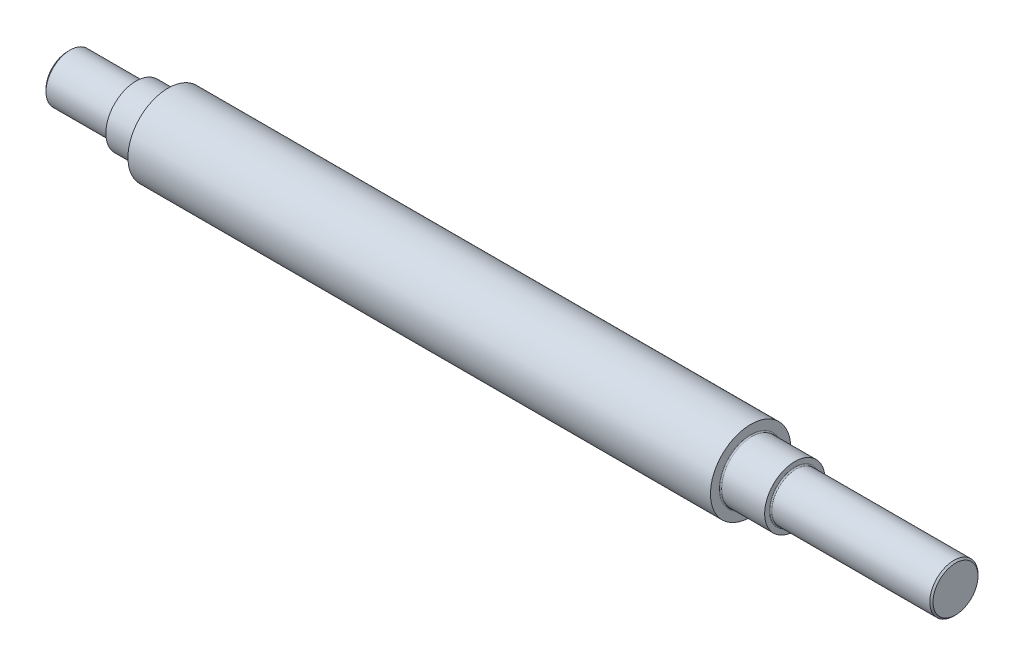
ISO-10303-21;
HEADER;
FILE_DESCRIPTION(('STEP AP214'),'2;1');
FILE_NAME('part.step','',(''),(''),'','','');
FILE_SCHEMA(('AUTOMOTIVE_DESIGN { 1 0 10303 214 1 1 1 1 }'));
ENDSEC;
DATA;
#1=APPLICATION_CONTEXT('core data for automotive mechanical design processes');
#2=APPLICATION_PROTOCOL_DEFINITION('international standard','automotive_design',2000,#1);
#3=PRODUCT_CONTEXT('',#1,'mechanical');
#4=PRODUCT('Part','Part','',(#3));
#5=PRODUCT_RELATED_PRODUCT_CATEGORY('part','',(#4));
#6=PRODUCT_DEFINITION_FORMATION('','',#4);
#7=PRODUCT_DEFINITION_CONTEXT('part definition',#1,'design');
#8=PRODUCT_DEFINITION('design','',#6,#7);
#9=PRODUCT_DEFINITION_SHAPE('','',#8);
#10=(LENGTH_UNIT() NAMED_UNIT(*) SI_UNIT(.MILLI.,.METRE.));
#11=(NAMED_UNIT(*) PLANE_ANGLE_UNIT() SI_UNIT($,.RADIAN.));
#12=(NAMED_UNIT(*) SI_UNIT($,.STERADIAN.) SOLID_ANGLE_UNIT());
#13=UNCERTAINTY_MEASURE_WITH_UNIT(LENGTH_MEASURE(1.E-05),#10,'distance_accuracy_value','');
#14=(GEOMETRIC_REPRESENTATION_CONTEXT(3) GLOBAL_UNCERTAINTY_ASSIGNED_CONTEXT((#13)) GLOBAL_UNIT_ASSIGNED_CONTEXT((#10,
#11,#12)) REPRESENTATION_CONTEXT('',''));
#15=CARTESIAN_POINT('',(0.,0.,0.));
#16=DIRECTION('',(0.,0.,1.));
#17=DIRECTION('',(1.,0.,0.));
#18=AXIS2_PLACEMENT_3D('',#15,#16,#17);
#19=CARTESIAN_POINT('',(221.,2.8,0.));
#20=DIRECTION('',(1.,0.,0.));
#21=DIRECTION('',(0.,0.,-1.));
#22=AXIS2_PLACEMENT_3D('',#19,#20,#21);
#23=PLANE('',#22);
#24=CARTESIAN_POINT('',(221.00000000006,0.,0.));
#25=DIRECTION('',(-1.,0.,0.));
#26=DIRECTION('',(0.,0.,1.));
#27=AXIS2_PLACEMENT_3D('',#24,#25,#26);
#28=CIRCLE('',#27,5.60000000001537);
#29=CARTESIAN_POINT('',(221.00000000006,0.,5.60000000001537));
#30=VERTEX_POINT('',#29);
#31=EDGE_CURVE('E271',#30,#30,#28,.T.);
#32=ORIENTED_EDGE('',*,*,#31,.F.);
#33=EDGE_LOOP('',(#32));
#34=FACE_BOUND('',#33,.T.);
#35=ADVANCED_FACE('F24',(#34),#23,.T.);
#36=CARTESIAN_POINT('',(0.,2.7,0.));
#37=DIRECTION('',(-1.,0.,0.));
#38=DIRECTION('',(0.,0.,1.));
#39=AXIS2_PLACEMENT_3D('',#36,#37,#38);
#40=PLANE('',#39);
#41=CARTESIAN_POINT('',(0.,0.,0.));
#42=DIRECTION('',(1.,0.,0.));
#43=DIRECTION('',(0.,0.,-1.));
#44=AXIS2_PLACEMENT_3D('',#41,#42,#43);
#45=CIRCLE('',#44,5.39999999995189);
#46=CARTESIAN_POINT('',(0.,0.,-5.39999999995189));
#47=VERTEX_POINT('',#46);
#48=EDGE_CURVE('E267',#47,#47,#45,.T.);
#49=ORIENTED_EDGE('',*,*,#48,.F.);
#50=EDGE_LOOP('',(#49));
#51=FACE_BOUND('',#50,.T.);
#52=ADVANCED_FACE('F486',(#51),#40,.T.);
#53=CARTESIAN_POINT('',(220.59999999999,0.,0.));
#54=DIRECTION('',(-1.,0.,0.));
#55=DIRECTION('',(0.,0.,1.));
#56=AXIS2_PLACEMENT_3D('',#53,#54,#55);
#57=CONICAL_SURFACE('',#56,6.00000000008549,0.785398163397448);
#58=ORIENTED_EDGE('',*,*,#31,.T.);
#59=EDGE_LOOP('',(#58));
#60=FACE_BOUND('',#59,.T.);
#61=CARTESIAN_POINT('',(220.6,0.,0.));
#62=DIRECTION('',(1.,0.,0.));
#63=DIRECTION('',(0.,0.,-1.));
#64=AXIS2_PLACEMENT_3D('',#61,#62,#63);
#65=CIRCLE('',#64,5.99999999999999);
#66=CARTESIAN_POINT('',(220.6,0.,-5.99999999999999));
#67=VERTEX_POINT('',#66);
#68=EDGE_CURVE('E270',#67,#67,#65,.F.);
#69=ORIENTED_EDGE('',*,*,#68,.F.);
#70=EDGE_LOOP('',(#69));
#71=FACE_BOUND('',#70,.T.);
#72=ADVANCED_FACE('F476',(#60,#71),#57,.T.);
#73=CARTESIAN_POINT('',(0.600000000076761,0.,0.));
#74=DIRECTION('',(1.,0.,0.));
#75=DIRECTION('',(0.,0.,-1.));
#76=AXIS2_PLACEMENT_3D('',#73,#74,#75);
#77=CONICAL_SURFACE('',#76,6.00000000008549,0.785398163444818);
#78=ORIENTED_EDGE('',*,*,#48,.T.);
#79=EDGE_LOOP('',(#78));
#80=FACE_BOUND('',#79,.T.);
#81=CARTESIAN_POINT('',(0.6,0.,0.));
#82=DIRECTION('',(1.,0.,0.));
#83=DIRECTION('',(0.,0.,-1.));
#84=AXIS2_PLACEMENT_3D('',#81,#82,#83);
#85=CIRCLE('',#84,6.);
#86=CARTESIAN_POINT('',(0.6,0.,-6.));
#87=VERTEX_POINT('',#86);
#88=EDGE_CURVE('E377',#87,#87,#85,.T.);
#89=ORIENTED_EDGE('',*,*,#88,.F.);
#90=EDGE_LOOP('',(#89));
#91=FACE_BOUND('',#90,.T.);
#92=ADVANCED_FACE('F467',(#80,#91),#77,.T.);
#93=CARTESIAN_POINT('',(200.95,0.,0.));
#94=DIRECTION('',(1.,0.,0.));
#95=DIRECTION('',(0.,0.,-1.));
#96=AXIS2_PLACEMENT_3D('',#93,#94,#95);
#97=CYLINDRICAL_SURFACE('',#96,5.99999999999999);
#98=ORIENTED_EDGE('',*,*,#68,.T.);
#99=EDGE_LOOP('',(#98));
#100=FACE_BOUND('',#99,.T.);
#101=CARTESIAN_POINT('',(181.3,0.,0.));
#102=DIRECTION('',(-1.,0.,0.));
#103=DIRECTION('',(0.,0.,1.));
#104=AXIS2_PLACEMENT_3D('',#101,#102,#103);
#105=CIRCLE('',#104,5.99999999999999);
#106=CARTESIAN_POINT('',(181.3,0.,5.99999999999999));
#107=VERTEX_POINT('',#106);
#108=EDGE_CURVE('E380',#107,#107,#105,.F.);
#109=ORIENTED_EDGE('',*,*,#108,.T.);
#110=EDGE_LOOP('',(#109));
#111=FACE_BOUND('',#110,.T.);
#112=ADVANCED_FACE('F458',(#100,#111),#97,.T.);
#113=CARTESIAN_POINT('',(8.65,0.,0.));
#114=DIRECTION('',(1.,0.,0.));
#115=DIRECTION('',(0.,0.,-1.));
#116=AXIS2_PLACEMENT_3D('',#113,#114,#115);
#117=CYLINDRICAL_SURFACE('',#116,6.);
#118=ORIENTED_EDGE('',*,*,#88,.T.);
#119=EDGE_LOOP('',(#118));
#120=FACE_BOUND('',#119,.T.);
#121=CARTESIAN_POINT('',(16.7,0.,0.));
#122=DIRECTION('',(-1.,0.,0.));
#123=DIRECTION('',(0.,0.,1.));
#124=AXIS2_PLACEMENT_3D('',#121,#122,#123);
#125=CIRCLE('',#124,6.);
#126=CARTESIAN_POINT('',(16.7,0.,6.));
#127=VERTEX_POINT('',#126);
#128=EDGE_CURVE('E382',#127,#127,#125,.T.);
#129=ORIENTED_EDGE('',*,*,#128,.T.);
#130=EDGE_LOOP('',(#129));
#131=FACE_BOUND('',#130,.T.);
#132=ADVANCED_FACE('F142',(#120,#131),#117,.T.);
#133=CARTESIAN_POINT('',(181.3,0.,0.));
#134=DIRECTION('',(-1.,0.,0.));
#135=DIRECTION('',(0.,0.,1.));
#136=AXIS2_PLACEMENT_3D('',#133,#134,#135);
#137=TOROIDAL_SURFACE('',#136,6.30000000000003,0.30000000000004);
#138=ORIENTED_EDGE('',*,*,#108,.F.);
#139=EDGE_LOOP('',(#138));
#140=FACE_BOUND('',#139,.T.);
#141=CARTESIAN_POINT('',(181.,0.,0.));
#142=DIRECTION('',(1.,0.,0.));
#143=DIRECTION('',(0.,1.,0.));
#144=AXIS2_PLACEMENT_3D('',#141,#142,#143);
#145=CIRCLE('',#144,6.30000000000003);
#146=CARTESIAN_POINT('',(181.,0.,6.30000000000003));
#147=VERTEX_POINT('',#146);
#148=CARTESIAN_POINT('',(181.,6.30000000000001,0.));
#149=VERTEX_POINT('',#148);
#150=EDGE_CURVE('E82',#147,#149,#145,.F.);
#151=ORIENTED_EDGE('',*,*,#150,.F.);
#152=CARTESIAN_POINT('',(181.,0.,0.));
#153=DIRECTION('',(1.,0.,0.));
#154=DIRECTION('',(0.,0.,1.));
#155=AXIS2_PLACEMENT_3D('',#152,#153,#154);
#156=CIRCLE('',#155,6.30000000000003);
#157=CARTESIAN_POINT('',(181.,0.,-6.30000000000002));
#158=VERTEX_POINT('',#157);
#159=EDGE_CURVE('E75',#158,#147,#156,.F.);
#160=ORIENTED_EDGE('',*,*,#159,.F.);
#161=CARTESIAN_POINT('',(181.,0.,0.));
#162=DIRECTION('',(1.,0.,0.));
#163=DIRECTION('',(0.,0.,-1.));
#164=AXIS2_PLACEMENT_3D('',#161,#162,#163);
#165=CIRCLE('',#164,6.3);
#166=EDGE_CURVE('E79',#149,#158,#165,.F.);
#167=ORIENTED_EDGE('',*,*,#166,.F.);
#168=EDGE_LOOP('',(#151,#160,#167));
#169=FACE_BOUND('',#168,.T.);
#170=ADVANCED_FACE('F78',(#140,#169),#137,.F.);
#171=CARTESIAN_POINT('',(16.7,0.,0.));
#172=DIRECTION('',(-1.,0.,0.));
#173=DIRECTION('',(0.,0.,1.));
#174=AXIS2_PLACEMENT_3D('',#171,#172,#173);
#175=TOROIDAL_SURFACE('',#174,6.3,0.300000000000001);
#176=CARTESIAN_POINT('',(17.,0.,0.));
#177=DIRECTION('',(-1.,0.,0.));
#178=DIRECTION('',(0.,0.,-1.));
#179=AXIS2_PLACEMENT_3D('',#176,#177,#178);
#180=CIRCLE('',#179,6.3);
#181=CARTESIAN_POINT('',(17.,0.,6.3));
#182=VERTEX_POINT('',#181);
#183=CARTESIAN_POINT('',(17.,0.,-6.3));
#184=VERTEX_POINT('',#183);
#185=EDGE_CURVE('E129',#182,#184,#180,.F.);
#186=ORIENTED_EDGE('',*,*,#185,.F.);
#187=CARTESIAN_POINT('',(17.,0.,0.));
#188=DIRECTION('',(-1.,0.,0.));
#189=DIRECTION('',(0.,0.,1.));
#190=AXIS2_PLACEMENT_3D('',#187,#188,#189);
#191=CIRCLE('',#190,6.3);
#192=CARTESIAN_POINT('',(17.,6.3,0.));
#193=VERTEX_POINT('',#192);
#194=EDGE_CURVE('E178',#193,#182,#191,.F.);
#195=ORIENTED_EDGE('',*,*,#194,.F.);
#196=CARTESIAN_POINT('',(17.,0.,0.));
#197=DIRECTION('',(-1.,0.,0.));
#198=DIRECTION('',(0.,1.,0.));
#199=AXIS2_PLACEMENT_3D('',#196,#197,#198);
#200=CIRCLE('',#199,6.3);
#201=EDGE_CURVE('E85',#184,#193,#200,.F.);
#202=ORIENTED_EDGE('',*,*,#201,.F.);
#203=EDGE_LOOP('',(#186,#195,#202));
#204=FACE_BOUND('',#203,.T.);
#205=ORIENTED_EDGE('',*,*,#128,.F.);
#206=EDGE_LOOP('',(#205));
#207=FACE_BOUND('',#206,.T.);
#208=ADVANCED_FACE('F110',(#204,#207),#175,.F.);
#209=CARTESIAN_POINT('',(181.,3.75,0.));
#210=DIRECTION('',(1.,0.,0.));
#211=DIRECTION('',(0.,0.,-1.));
#212=AXIS2_PLACEMENT_3D('',#209,#210,#211);
#213=PLANE('',#212);
#214=ORIENTED_EDGE('',*,*,#166,.T.);
#215=ORIENTED_EDGE('',*,*,#159,.T.);
#216=ORIENTED_EDGE('',*,*,#150,.T.);
#217=EDGE_LOOP('',(#214,#215,#216));
#218=FACE_BOUND('',#217,.T.);
#219=CARTESIAN_POINT('',(181.,0.,0.));
#220=DIRECTION('',(1.,0.,0.));
#221=DIRECTION('',(0.,0.,-1.));
#222=AXIS2_PLACEMENT_3D('',#219,#220,#221);
#223=CIRCLE('',#222,7.49999999999999);
#224=CARTESIAN_POINT('',(181.,0.,-7.49999999999999));
#225=VERTEX_POINT('',#224);
#226=EDGE_CURVE('E258',#225,#225,#223,.F.);
#227=ORIENTED_EDGE('',*,*,#226,.F.);
#228=EDGE_LOOP('',(#227));
#229=FACE_BOUND('',#228,.T.);
#230=ADVANCED_FACE('F89',(#218,#229),#213,.T.);
#231=CARTESIAN_POINT('',(17.,3.75,0.));
#232=DIRECTION('',(-1.,0.,0.));
#233=DIRECTION('',(0.,0.,1.));
#234=AXIS2_PLACEMENT_3D('',#231,#232,#233);
#235=PLANE('',#234);
#236=ORIENTED_EDGE('',*,*,#194,.T.);
#237=ORIENTED_EDGE('',*,*,#185,.T.);
#238=ORIENTED_EDGE('',*,*,#201,.T.);
#239=EDGE_LOOP('',(#236,#237,#238));
#240=FACE_BOUND('',#239,.T.);
#241=CARTESIAN_POINT('',(17.,0.,0.));
#242=DIRECTION('',(1.,0.,0.));
#243=DIRECTION('',(0.,0.,-1.));
#244=AXIS2_PLACEMENT_3D('',#241,#242,#243);
#245=CIRCLE('',#244,7.5);
#246=CARTESIAN_POINT('',(17.,0.,-7.5));
#247=VERTEX_POINT('',#246);
#248=EDGE_CURVE('E229',#247,#247,#245,.T.);
#249=ORIENTED_EDGE('',*,*,#248,.F.);
#250=EDGE_LOOP('',(#249));
#251=FACE_BOUND('',#250,.T.);
#252=ADVANCED_FACE('F109',(#240,#251),#235,.T.);
#253=CARTESIAN_POINT('',(175.65,0.,0.));
#254=DIRECTION('',(1.,0.,0.));
#255=DIRECTION('',(0.,0.,-1.));
#256=AXIS2_PLACEMENT_3D('',#253,#254,#255);
#257=CYLINDRICAL_SURFACE('',#256,7.49999999999999);
#258=ORIENTED_EDGE('',*,*,#226,.T.);
#259=EDGE_LOOP('',(#258));
#260=FACE_BOUND('',#259,.T.);
#261=CARTESIAN_POINT('',(170.3,0.,0.));
#262=DIRECTION('',(-1.,0.,0.));
#263=DIRECTION('',(0.,0.,1.));
#264=AXIS2_PLACEMENT_3D('',#261,#262,#263);
#265=CIRCLE('',#264,7.49999999999999);
#266=CARTESIAN_POINT('',(170.3,0.,7.49999999999999));
#267=VERTEX_POINT('',#266);
#268=EDGE_CURVE('E226',#267,#267,#265,.F.);
#269=ORIENTED_EDGE('',*,*,#268,.T.);
#270=EDGE_LOOP('',(#269));
#271=FACE_BOUND('',#270,.T.);
#272=ADVANCED_FACE('F421',(#260,#271),#257,.T.);
#273=CARTESIAN_POINT('',(20.85,0.,0.));
#274=DIRECTION('',(1.,0.,0.));
#275=DIRECTION('',(0.,0.,-1.));
#276=AXIS2_PLACEMENT_3D('',#273,#274,#275);
#277=CYLINDRICAL_SURFACE('',#276,7.5);
#278=ORIENTED_EDGE('',*,*,#248,.T.);
#279=EDGE_LOOP('',(#278));
#280=FACE_BOUND('',#279,.T.);
#281=CARTESIAN_POINT('',(24.7,0.,0.));
#282=DIRECTION('',(-1.,0.,0.));
#283=DIRECTION('',(0.,0.,1.));
#284=AXIS2_PLACEMENT_3D('',#281,#282,#283);
#285=CIRCLE('',#284,7.5);
#286=CARTESIAN_POINT('',(24.7,0.,7.5));
#287=VERTEX_POINT('',#286);
#288=EDGE_CURVE('E217',#287,#287,#285,.T.);
#289=ORIENTED_EDGE('',*,*,#288,.T.);
#290=EDGE_LOOP('',(#289));
#291=FACE_BOUND('',#290,.T.);
#292=ADVANCED_FACE('F196',(#280,#291),#277,.T.);
#293=CARTESIAN_POINT('',(170.3,0.,0.));
#294=DIRECTION('',(-1.,0.,0.));
#295=DIRECTION('',(0.,0.,1.));
#296=AXIS2_PLACEMENT_3D('',#293,#294,#295);
#297=TOROIDAL_SURFACE('',#296,7.80000000000003,0.30000000000004);
#298=ORIENTED_EDGE('',*,*,#268,.F.);
#299=EDGE_LOOP('',(#298));
#300=FACE_BOUND('',#299,.T.);
#301=CARTESIAN_POINT('',(170.,0.,0.));
#302=DIRECTION('',(1.,0.,0.));
#303=DIRECTION('',(0.,1.,0.));
#304=AXIS2_PLACEMENT_3D('',#301,#302,#303);
#305=CIRCLE('',#304,7.80000000000003);
#306=CARTESIAN_POINT('',(170.,0.,7.80000000000003));
#307=VERTEX_POINT('',#306);
#308=CARTESIAN_POINT('',(170.,7.80000000000001,0.));
#309=VERTEX_POINT('',#308);
#310=EDGE_CURVE('E225',#307,#309,#305,.F.);
#311=ORIENTED_EDGE('',*,*,#310,.F.);
#312=CARTESIAN_POINT('',(170.,0.,0.));
#313=DIRECTION('',(1.,0.,0.));
#314=DIRECTION('',(0.,0.,1.));
#315=AXIS2_PLACEMENT_3D('',#312,#313,#314);
#316=CIRCLE('',#315,7.80000000000003);
#317=CARTESIAN_POINT('',(170.,0.,-7.80000000000002));
#318=VERTEX_POINT('',#317);
#319=EDGE_CURVE('E212',#318,#307,#316,.F.);
#320=ORIENTED_EDGE('',*,*,#319,.F.);
#321=CARTESIAN_POINT('',(170.,0.,0.));
#322=DIRECTION('',(1.,0.,0.));
#323=DIRECTION('',(0.,0.,-1.));
#324=AXIS2_PLACEMENT_3D('',#321,#322,#323);
#325=CIRCLE('',#324,7.8);
#326=EDGE_CURVE('E295',#309,#318,#325,.F.);
#327=ORIENTED_EDGE('',*,*,#326,.F.);
#328=EDGE_LOOP('',(#311,#320,#327));
#329=FACE_BOUND('',#328,.T.);
#330=ADVANCED_FACE('F184',(#300,#329),#297,.F.);
#331=CARTESIAN_POINT('',(24.7,0.,0.));
#332=DIRECTION('',(-1.,0.,0.));
#333=DIRECTION('',(0.,0.,1.));
#334=AXIS2_PLACEMENT_3D('',#331,#332,#333);
#335=TOROIDAL_SURFACE('',#334,7.8,0.300000000000001);
#336=CARTESIAN_POINT('',(25.,0.,0.));
#337=DIRECTION('',(-1.,0.,0.));
#338=DIRECTION('',(0.,0.,-1.));
#339=AXIS2_PLACEMENT_3D('',#336,#337,#338);
#340=CIRCLE('',#339,7.8);
#341=CARTESIAN_POINT('',(25.,0.,7.8));
#342=VERTEX_POINT('',#341);
#343=CARTESIAN_POINT('',(25.,0.,-7.8));
#344=VERTEX_POINT('',#343);
#345=EDGE_CURVE('E44',#342,#344,#340,.F.);
#346=ORIENTED_EDGE('',*,*,#345,.F.);
#347=CARTESIAN_POINT('',(25.,0.,0.));
#348=DIRECTION('',(-1.,0.,0.));
#349=DIRECTION('',(0.,0.,1.));
#350=AXIS2_PLACEMENT_3D('',#347,#348,#349);
#351=CIRCLE('',#350,7.8);
#352=CARTESIAN_POINT('',(25.,7.8,0.));
#353=VERTEX_POINT('',#352);
#354=EDGE_CURVE('E275',#353,#342,#351,.F.);
#355=ORIENTED_EDGE('',*,*,#354,.F.);
#356=CARTESIAN_POINT('',(25.,0.,0.));
#357=DIRECTION('',(-1.,0.,0.));
#358=DIRECTION('',(0.,1.,0.));
#359=AXIS2_PLACEMENT_3D('',#356,#357,#358);
#360=CIRCLE('',#359,7.8);
#361=EDGE_CURVE('E286',#344,#353,#360,.F.);
#362=ORIENTED_EDGE('',*,*,#361,.F.);
#363=EDGE_LOOP('',(#346,#355,#362));
#364=FACE_BOUND('',#363,.T.);
#365=ORIENTED_EDGE('',*,*,#288,.F.);
#366=EDGE_LOOP('',(#365));
#367=FACE_BOUND('',#366,.T.);
#368=ADVANCED_FACE('F195',(#364,#367),#335,.F.);
#369=CARTESIAN_POINT('',(170.,5.,0.));
#370=DIRECTION('',(1.,0.,0.));
#371=DIRECTION('',(0.,0.,-1.));
#372=AXIS2_PLACEMENT_3D('',#369,#370,#371);
#373=PLANE('',#372);
#374=ORIENTED_EDGE('',*,*,#326,.T.);
#375=ORIENTED_EDGE('',*,*,#319,.T.);
#376=ORIENTED_EDGE('',*,*,#310,.T.);
#377=EDGE_LOOP('',(#374,#375,#376));
#378=FACE_BOUND('',#377,.T.);
#379=CARTESIAN_POINT('',(170.,0.,0.));
#380=DIRECTION('',(1.,0.,0.));
#381=DIRECTION('',(0.,0.,-1.));
#382=AXIS2_PLACEMENT_3D('',#379,#380,#381);
#383=CIRCLE('',#382,10.);
#384=CARTESIAN_POINT('',(170.,0.,-10.));
#385=VERTEX_POINT('',#384);
#386=EDGE_CURVE('E35',#385,#385,#383,.F.);
#387=ORIENTED_EDGE('',*,*,#386,.F.);
#388=EDGE_LOOP('',(#387));
#389=FACE_BOUND('',#388,.T.);
#390=ADVANCED_FACE('F307',(#378,#389),#373,.T.);
#391=CARTESIAN_POINT('',(25.,5.,0.));
#392=DIRECTION('',(-1.,0.,0.));
#393=DIRECTION('',(0.,0.,1.));
#394=AXIS2_PLACEMENT_3D('',#391,#392,#393);
#395=PLANE('',#394);
#396=ORIENTED_EDGE('',*,*,#354,.T.);
#397=ORIENTED_EDGE('',*,*,#345,.T.);
#398=ORIENTED_EDGE('',*,*,#361,.T.);
#399=EDGE_LOOP('',(#396,#397,#398));
#400=FACE_BOUND('',#399,.T.);
#401=CARTESIAN_POINT('',(25.,0.,0.));
#402=DIRECTION('',(1.,0.,0.));
#403=DIRECTION('',(0.,0.,-1.));
#404=AXIS2_PLACEMENT_3D('',#401,#402,#403);
#405=CIRCLE('',#404,10.);
#406=CARTESIAN_POINT('',(25.,0.,-10.));
#407=VERTEX_POINT('',#406);
#408=EDGE_CURVE('E12',#407,#407,#405,.T.);
#409=ORIENTED_EDGE('',*,*,#408,.F.);
#410=EDGE_LOOP('',(#409));
#411=FACE_BOUND('',#410,.T.);
#412=ADVANCED_FACE('F326',(#400,#411),#395,.T.);
#413=CARTESIAN_POINT('',(97.5,0.,0.));
#414=DIRECTION('',(1.,0.,0.));
#415=DIRECTION('',(0.,0.,-1.));
#416=AXIS2_PLACEMENT_3D('',#413,#414,#415);
#417=CYLINDRICAL_SURFACE('',#416,10.);
#418=ORIENTED_EDGE('',*,*,#386,.T.);
#419=EDGE_LOOP('',(#418));
#420=FACE_BOUND('',#419,.T.);
#421=ORIENTED_EDGE('',*,*,#408,.T.);
#422=EDGE_LOOP('',(#421));
#423=FACE_BOUND('',#422,.T.);
#424=ADVANCED_FACE('F348',(#420,#423),#417,.T.);
#425=CLOSED_SHELL('',(#35,#52,#72,#92,#112,#132,#170,#208,#230,#252,#272,#292,#330,#368,#390,
#412,#424));
#426=MANIFOLD_SOLID_BREP('B1',#425);
#427=ADVANCED_BREP_SHAPE_REPRESENTATION('',(#18,#426),#14);
#428=SHAPE_DEFINITION_REPRESENTATION(#9,#427);
ENDSEC;
END-ISO-10303-21;
